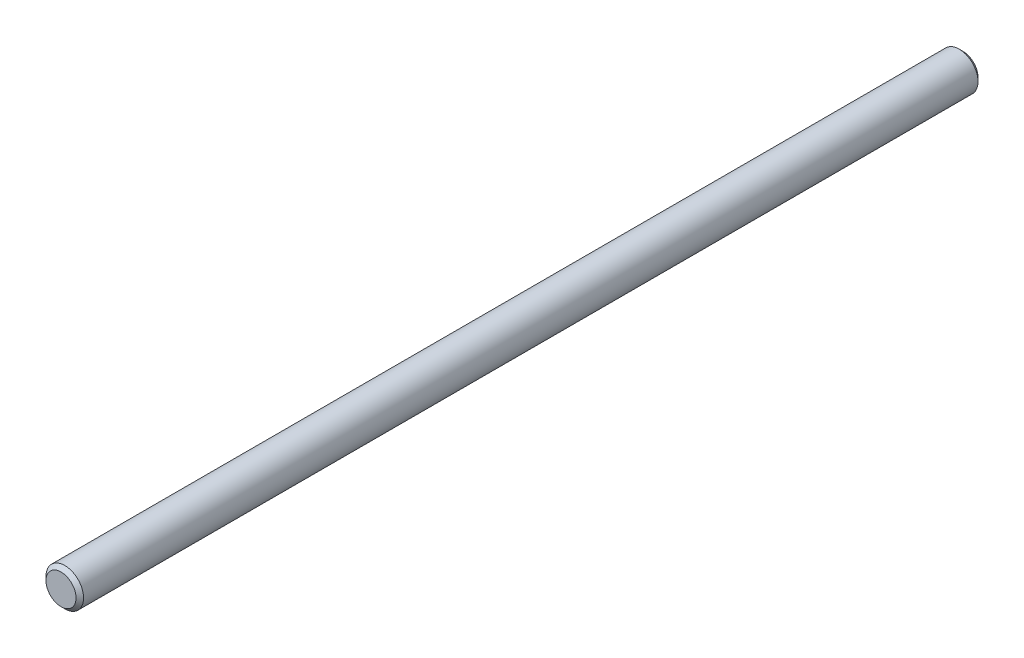
ISO-10303-21;
HEADER;
FILE_DESCRIPTION(('STEP AP214'),'2;1');
FILE_NAME('part.step','',(''),(''),'','','');
FILE_SCHEMA(('AUTOMOTIVE_DESIGN { 1 0 10303 214 1 1 1 1 }'));
ENDSEC;
DATA;
#1=APPLICATION_CONTEXT('core data for automotive mechanical design processes');
#2=APPLICATION_PROTOCOL_DEFINITION('international standard','automotive_design',2000,#1);
#3=PRODUCT_CONTEXT('',#1,'mechanical');
#4=PRODUCT('Part','Part','',(#3));
#5=PRODUCT_RELATED_PRODUCT_CATEGORY('part','',(#4));
#6=PRODUCT_DEFINITION_FORMATION('','',#4);
#7=PRODUCT_DEFINITION_CONTEXT('part definition',#1,'design');
#8=PRODUCT_DEFINITION('design','',#6,#7);
#9=PRODUCT_DEFINITION_SHAPE('','',#8);
#10=(LENGTH_UNIT() NAMED_UNIT(*) SI_UNIT(.MILLI.,.METRE.));
#11=(NAMED_UNIT(*) PLANE_ANGLE_UNIT() SI_UNIT($,.RADIAN.));
#12=(NAMED_UNIT(*) SI_UNIT($,.STERADIAN.) SOLID_ANGLE_UNIT());
#13=UNCERTAINTY_MEASURE_WITH_UNIT(LENGTH_MEASURE(1.E-05),#10,'distance_accuracy_value','');
#14=(GEOMETRIC_REPRESENTATION_CONTEXT(3) GLOBAL_UNCERTAINTY_ASSIGNED_CONTEXT((#13)) GLOBAL_UNIT_ASSIGNED_CONTEXT((#10,
#11,#12)) REPRESENTATION_CONTEXT('',''));
#15=CARTESIAN_POINT('',(0.,0.,0.));
#16=DIRECTION('',(0.,0.,1.));
#17=DIRECTION('',(1.,0.,0.));
#18=AXIS2_PLACEMENT_3D('',#15,#16,#17);
#19=CARTESIAN_POINT('',(0.,0.,76.2));
#20=DIRECTION('',(0.,0.,-1.));
#21=DIRECTION('',(-1.,0.,0.));
#22=AXIS2_PLACEMENT_3D('',#19,#20,#21);
#23=CYLINDRICAL_SURFACE('',#22,3.175);
#24=CARTESIAN_POINT('',(0.,0.,-75.5649999999999));
#25=DIRECTION('',(0.,0.,1.));
#26=DIRECTION('',(1.,0.,0.));
#27=AXIS2_PLACEMENT_3D('',#24,#25,#26);
#28=CIRCLE('',#27,3.175);
#29=CARTESIAN_POINT('',(3.175,0.,-75.5649999999999));
#30=VERTEX_POINT('',#29);
#31=EDGE_CURVE('E42',#30,#30,#28,.T.);
#32=ORIENTED_EDGE('',*,*,#31,.T.);
#33=EDGE_LOOP('',(#32));
#34=FACE_BOUND('',#33,.T.);
#35=CARTESIAN_POINT('',(0.,0.,75.5650000000001));
#36=DIRECTION('',(0.,0.,1.));
#37=DIRECTION('',(1.,0.,0.));
#38=AXIS2_PLACEMENT_3D('',#35,#36,#37);
#39=CIRCLE('',#38,3.175);
#40=CARTESIAN_POINT('',(3.175,0.,75.5650000000001));
#41=VERTEX_POINT('',#40);
#42=EDGE_CURVE('E46',#41,#41,#39,.F.);
#43=ORIENTED_EDGE('',*,*,#42,.T.);
#44=EDGE_LOOP('',(#43));
#45=FACE_BOUND('',#44,.T.);
#46=ADVANCED_FACE('F31',(#34,#45),#23,.T.);
#47=CARTESIAN_POINT('',(0.,0.,76.2));
#48=DIRECTION('',(0.,0.,1.));
#49=DIRECTION('',(1.,0.,0.));
#50=AXIS2_PLACEMENT_3D('',#47,#48,#49);
#51=PLANE('',#50);
#52=CARTESIAN_POINT('',(0.,0.,76.2));
#53=DIRECTION('',(0.,0.,1.));
#54=DIRECTION('',(1.,0.,0.));
#55=AXIS2_PLACEMENT_3D('',#52,#53,#54);
#56=CIRCLE('',#55,2.54000000000008);
#57=CARTESIAN_POINT('',(2.54000000000008,0.,76.2));
#58=VERTEX_POINT('',#57);
#59=EDGE_CURVE('E10',#58,#58,#56,.T.);
#60=ORIENTED_EDGE('',*,*,#59,.T.);
#61=EDGE_LOOP('',(#60));
#62=FACE_BOUND('',#61,.T.);
#63=ADVANCED_FACE('F62',(#62),#51,.T.);
#64=CARTESIAN_POINT('',(0.,0.,-76.2));
#65=DIRECTION('',(0.,0.,1.));
#66=DIRECTION('',(1.,0.,0.));
#67=AXIS2_PLACEMENT_3D('',#64,#65,#66);
#68=PLANE('',#67);
#69=CARTESIAN_POINT('',(0.,0.,-76.2));
#70=DIRECTION('',(0.,0.,1.));
#71=DIRECTION('',(1.,0.,0.));
#72=AXIS2_PLACEMENT_3D('',#69,#70,#71);
#73=CIRCLE('',#72,2.53999999999988);
#74=CARTESIAN_POINT('',(2.53999999999988,0.,-76.2));
#75=VERTEX_POINT('',#74);
#76=EDGE_CURVE('E38',#75,#75,#73,.F.);
#77=ORIENTED_EDGE('',*,*,#76,.T.);
#78=EDGE_LOOP('',(#77));
#79=FACE_BOUND('',#78,.T.);
#80=ADVANCED_FACE('F59',(#79),#68,.F.);
#81=CARTESIAN_POINT('',(0.,0.,-75.5649999999999));
#82=DIRECTION('',(0.,0.,1.));
#83=DIRECTION('',(1.,0.,0.));
#84=AXIS2_PLACEMENT_3D('',#81,#82,#83);
#85=CONICAL_SURFACE('',#84,3.175,0.78539816339744);
#86=ORIENTED_EDGE('',*,*,#76,.F.);
#87=EDGE_LOOP('',(#86));
#88=FACE_BOUND('',#87,.T.);
#89=ORIENTED_EDGE('',*,*,#31,.F.);
#90=EDGE_LOOP('',(#89));
#91=FACE_BOUND('',#90,.T.);
#92=ADVANCED_FACE('F55',(#88,#91),#85,.T.);
#93=CARTESIAN_POINT('',(0.,0.,76.2));
#94=DIRECTION('',(0.,0.,-1.));
#95=DIRECTION('',(-1.,0.,0.));
#96=AXIS2_PLACEMENT_3D('',#93,#94,#95);
#97=CONICAL_SURFACE('',#96,2.54000000000008,0.785398163397451);
#98=ORIENTED_EDGE('',*,*,#42,.F.);
#99=EDGE_LOOP('',(#98));
#100=FACE_BOUND('',#99,.T.);
#101=ORIENTED_EDGE('',*,*,#59,.F.);
#102=EDGE_LOOP('',(#101));
#103=FACE_BOUND('',#102,.T.);
#104=ADVANCED_FACE('F33',(#100,#103),#97,.T.);
#105=CLOSED_SHELL('',(#46,#63,#80,#92,#104));
#106=MANIFOLD_SOLID_BREP('B2',#105);
#107=ADVANCED_BREP_SHAPE_REPRESENTATION('',(#18,#106),#14);
#108=SHAPE_DEFINITION_REPRESENTATION(#9,#107);
ENDSEC;
END-ISO-10303-21;
